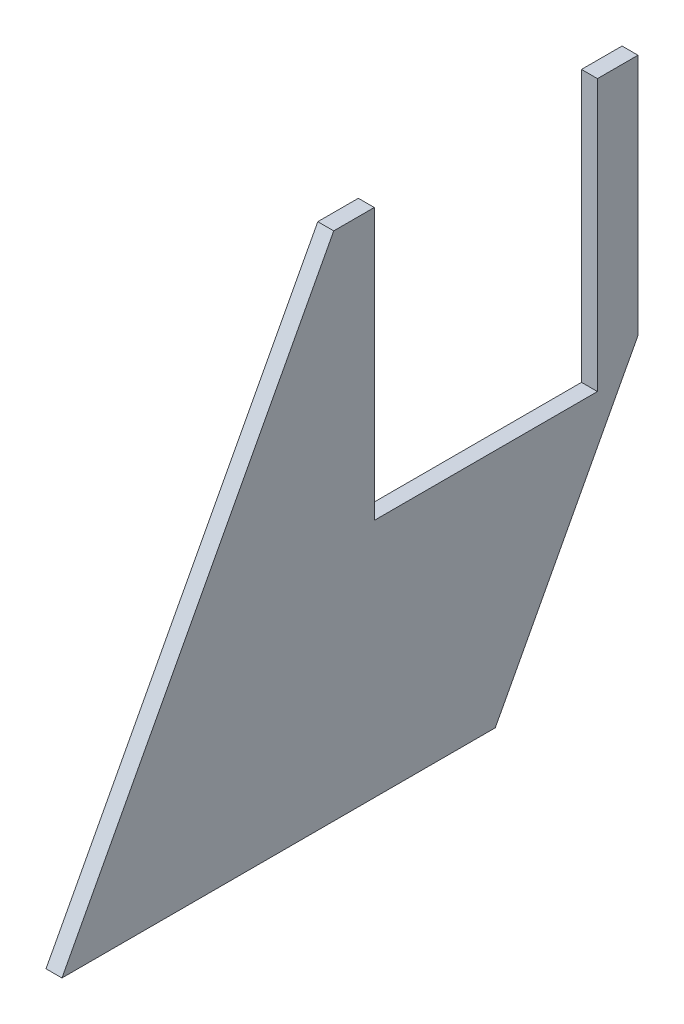
ISO-10303-21;
HEADER;
FILE_DESCRIPTION(('STEP AP214'),'2;1');
FILE_NAME('part.step','',(''),(''),'','','');
FILE_SCHEMA(('AUTOMOTIVE_DESIGN { 1 0 10303 214 1 1 1 1 }'));
ENDSEC;
DATA;
#1=APPLICATION_CONTEXT('core data for automotive mechanical design processes');
#2=APPLICATION_PROTOCOL_DEFINITION('international standard','automotive_design',2000,#1);
#3=PRODUCT_CONTEXT('',#1,'mechanical');
#4=PRODUCT('Part','Part','',(#3));
#5=PRODUCT_RELATED_PRODUCT_CATEGORY('part','',(#4));
#6=PRODUCT_DEFINITION_FORMATION('','',#4);
#7=PRODUCT_DEFINITION_CONTEXT('part definition',#1,'design');
#8=PRODUCT_DEFINITION('design','',#6,#7);
#9=PRODUCT_DEFINITION_SHAPE('','',#8);
#10=(LENGTH_UNIT() NAMED_UNIT(*) SI_UNIT(.MILLI.,.METRE.));
#11=(NAMED_UNIT(*) PLANE_ANGLE_UNIT() SI_UNIT($,.RADIAN.));
#12=(NAMED_UNIT(*) SI_UNIT($,.STERADIAN.) SOLID_ANGLE_UNIT());
#13=UNCERTAINTY_MEASURE_WITH_UNIT(LENGTH_MEASURE(1.E-05),#10,'distance_accuracy_value','');
#14=(GEOMETRIC_REPRESENTATION_CONTEXT(3) GLOBAL_UNCERTAINTY_ASSIGNED_CONTEXT((#13)) GLOBAL_UNIT_ASSIGNED_CONTEXT((#10,
#11,#12)) REPRESENTATION_CONTEXT('',''));
#15=CARTESIAN_POINT('',(0.,0.,0.));
#16=DIRECTION('',(0.,0.,1.));
#17=DIRECTION('',(1.,0.,0.));
#18=AXIS2_PLACEMENT_3D('',#15,#16,#17);
#19=CARTESIAN_POINT('',(43.65,-0.00999999999995449,-170.265974623788));
#20=DIRECTION('',(1.,0.,0.));
#21=DIRECTION('',(0.,0.,-1.));
#22=AXIS2_PLACEMENT_3D('',#19,#20,#21);
#23=PLANE('',#22);
#24=DIRECTION('',(0.,0.,1.));
#25=VECTOR('',#24,1.);
#26=CARTESIAN_POINT('',(43.65,203.6,0.));
#27=LINE('',#26,#25);
#28=CARTESIAN_POINT('',(43.65,203.6,-143.154202423773));
#29=VERTEX_POINT('',#28);
#30=CARTESIAN_POINT('',(43.65,203.6,-127.004202423773));
#31=VERTEX_POINT('',#30);
#32=EDGE_CURVE('E159',#29,#31,#27,.T.);
#33=ORIENTED_EDGE('',*,*,#32,.F.);
#34=DIRECTION('',(0.,1.,0.));
#35=VECTOR('',#34,1.);
#36=CARTESIAN_POINT('',(43.65,203.6,-143.154202423773));
#37=LINE('',#36,#35);
#38=CARTESIAN_POINT('',(43.65,106.923746647894,-143.154202423773));
#39=VERTEX_POINT('',#38);
#40=EDGE_CURVE('E173',#39,#29,#37,.T.);
#41=ORIENTED_EDGE('',*,*,#40,.F.);
#42=DIRECTION('',(0.,0.882947592858925,-0.469471562785895));
#43=VECTOR('',#42,1.);
#44=CARTESIAN_POINT('',(43.65,106.923746647894,-143.154202423773));
#45=LINE('',#44,#43);
#46=CARTESIAN_POINT('',(43.65,0.,-86.3018378625049));
#47=VERTEX_POINT('',#46);
#48=EDGE_CURVE('E115',#47,#39,#45,.T.);
#49=ORIENTED_EDGE('',*,*,#48,.F.);
#50=DIRECTION('',(0.,0.,-1.));
#51=VECTOR('',#50,1.);
#52=CARTESIAN_POINT('',(43.65,0.,0.));
#53=LINE('',#52,#51);
#54=CARTESIAN_POINT('',(43.65,0.,86.301837862505));
#55=VERTEX_POINT('',#54);
#56=EDGE_CURVE('E109',#55,#47,#53,.T.);
#57=ORIENTED_EDGE('',*,*,#56,.F.);
#58=DIRECTION('',(0.,-0.882947592858925,0.469471562785895));
#59=VECTOR('',#58,1.);
#60=CARTESIAN_POINT('',(43.65,0.,86.301837862505));
#61=LINE('',#60,#59);
#62=CARTESIAN_POINT('',(43.65,203.6,-21.9542024237733));
#63=VERTEX_POINT('',#62);
#64=EDGE_CURVE('E112',#63,#55,#61,.T.);
#65=ORIENTED_EDGE('',*,*,#64,.F.);
#66=DIRECTION('',(0.,0.,1.));
#67=VECTOR('',#66,1.);
#68=CARTESIAN_POINT('',(43.65,203.6,2.5115711979298E-13));
#69=LINE('',#68,#67);
#70=CARTESIAN_POINT('',(43.65,203.6,-38.1042024237733));
#71=VERTEX_POINT('',#70);
#72=EDGE_CURVE('E157',#71,#63,#69,.T.);
#73=ORIENTED_EDGE('',*,*,#72,.F.);
#74=DIRECTION('',(0.,1.,0.));
#75=VECTOR('',#74,1.);
#76=CARTESIAN_POINT('',(43.65,0.,-38.1042024237734));
#77=LINE('',#76,#75);
#78=CARTESIAN_POINT('',(43.65,95.6500000000001,-38.1042024237734));
#79=VERTEX_POINT('',#78);
#80=EDGE_CURVE('E11',#79,#71,#77,.T.);
#81=ORIENTED_EDGE('',*,*,#80,.F.);
#82=DIRECTION('',(0.,0.,1.));
#83=VECTOR('',#82,1.);
#84=CARTESIAN_POINT('',(43.65,95.65,0.));
#85=LINE('',#84,#83);
#86=CARTESIAN_POINT('',(43.65,95.6500000000001,-127.004202423773));
#87=VERTEX_POINT('',#86);
#88=EDGE_CURVE('E161',#87,#79,#85,.T.);
#89=ORIENTED_EDGE('',*,*,#88,.F.);
#90=DIRECTION('',(0.,-1.,0.));
#91=VECTOR('',#90,1.);
#92=CARTESIAN_POINT('',(43.65,0.,-127.004202423773));
#93=LINE('',#92,#91);
#94=EDGE_CURVE('E45',#31,#87,#93,.T.);
#95=ORIENTED_EDGE('',*,*,#94,.F.);
#96=EDGE_LOOP('',(#33,#41,#49,#57,#65,#73,#81,#89,#95));
#97=FACE_BOUND('',#96,.T.);
#98=ADVANCED_FACE('F36',(#97),#23,.F.);
#99=CARTESIAN_POINT('',(-67.585,95.6500000000001,-127.004202423773));
#100=DIRECTION('',(0.,-1.,0.));
#101=DIRECTION('',(0.,0.,-1.));
#102=AXIS2_PLACEMENT_3D('',#99,#100,#101);
#103=PLANE('',#102);
#104=DIRECTION('',(1.,0.,0.));
#105=VECTOR('',#104,1.);
#106=CARTESIAN_POINT('',(-67.585,95.6500000000001,-127.004202423773));
#107=LINE('',#106,#105);
#108=CARTESIAN_POINT('',(50.,95.6500000000001,-127.004202423773));
#109=VERTEX_POINT('',#108);
#110=EDGE_CURVE('E164',#87,#109,#107,.T.);
#111=ORIENTED_EDGE('',*,*,#110,.F.);
#112=ORIENTED_EDGE('',*,*,#88,.T.);
#113=DIRECTION('',(1.,0.,0.));
#114=VECTOR('',#113,1.);
#115=CARTESIAN_POINT('',(-67.585,95.6500000000001,-38.1042024237734));
#116=LINE('',#115,#114);
#117=CARTESIAN_POINT('',(50.,95.6500000000001,-38.1042024237734));
#118=VERTEX_POINT('',#117);
#119=EDGE_CURVE('E218',#79,#118,#116,.T.);
#120=ORIENTED_EDGE('',*,*,#119,.T.);
#121=DIRECTION('',(0.,0.,1.));
#122=VECTOR('',#121,1.);
#123=CARTESIAN_POINT('',(50.,95.6500000000001,0.));
#124=LINE('',#123,#122);
#125=EDGE_CURVE('E121',#109,#118,#124,.T.);
#126=ORIENTED_EDGE('',*,*,#125,.F.);
#127=EDGE_LOOP('',(#111,#112,#120,#126));
#128=FACE_BOUND('',#127,.T.);
#129=ADVANCED_FACE('F189',(#128),#103,.F.);
#130=CARTESIAN_POINT('',(-50.01,203.6,-38.1042024237733));
#131=DIRECTION('',(0.,0.,1.));
#132=DIRECTION('',(1.,0.,0.));
#133=AXIS2_PLACEMENT_3D('',#130,#131,#132);
#134=PLANE('',#133);
#135=ORIENTED_EDGE('',*,*,#80,.T.);
#136=DIRECTION('',(1.,0.,0.));
#137=VECTOR('',#136,1.);
#138=CARTESIAN_POINT('',(-50.01,203.6,-38.1042024237733));
#139=LINE('',#138,#137);
#140=CARTESIAN_POINT('',(50.,203.6,-38.1042024237733));
#141=VERTEX_POINT('',#140);
#142=EDGE_CURVE('E215',#71,#141,#139,.T.);
#143=ORIENTED_EDGE('',*,*,#142,.T.);
#144=DIRECTION('',(0.,-1.,0.));
#145=VECTOR('',#144,1.);
#146=CARTESIAN_POINT('',(50.,203.6,-38.1042024237733));
#147=LINE('',#146,#145);
#148=EDGE_CURVE('E60',#141,#118,#147,.T.);
#149=ORIENTED_EDGE('',*,*,#148,.T.);
#150=ORIENTED_EDGE('',*,*,#119,.F.);
#151=EDGE_LOOP('',(#135,#143,#149,#150));
#152=FACE_BOUND('',#151,.T.);
#153=ADVANCED_FACE('F195',(#152),#134,.F.);
#154=CARTESIAN_POINT('',(50.,0.,0.));
#155=DIRECTION('',(-1.,0.,0.));
#156=DIRECTION('',(0.,0.,1.));
#157=AXIS2_PLACEMENT_3D('',#154,#155,#156);
#158=PLANE('',#157);
#159=DIRECTION('',(0.,1.,0.));
#160=VECTOR('',#159,1.);
#161=CARTESIAN_POINT('',(50.,203.6,-127.004202423773));
#162=LINE('',#161,#160);
#163=CARTESIAN_POINT('',(50.,203.6,-127.004202423773));
#164=VERTEX_POINT('',#163);
#165=EDGE_CURVE('E174',#109,#164,#162,.T.);
#166=ORIENTED_EDGE('',*,*,#165,.F.);
#167=ORIENTED_EDGE('',*,*,#125,.T.);
#168=ORIENTED_EDGE('',*,*,#148,.F.);
#169=DIRECTION('',(0.,0.,1.));
#170=VECTOR('',#169,1.);
#171=CARTESIAN_POINT('',(50.,203.6,-21.9542024237733));
#172=LINE('',#171,#170);
#173=CARTESIAN_POINT('',(50.,203.6,-21.9542024237733));
#174=VERTEX_POINT('',#173);
#175=EDGE_CURVE('E147',#141,#174,#172,.T.);
#176=ORIENTED_EDGE('',*,*,#175,.T.);
#177=DIRECTION('',(0.,-0.882947592858925,0.469471562785895));
#178=VECTOR('',#177,1.);
#179=CARTESIAN_POINT('',(50.,0.,86.301837862505));
#180=LINE('',#179,#178);
#181=CARTESIAN_POINT('',(50.,0.,86.301837862505));
#182=VERTEX_POINT('',#181);
#183=EDGE_CURVE('E145',#174,#182,#180,.T.);
#184=ORIENTED_EDGE('',*,*,#183,.T.);
#185=DIRECTION('',(0.,0.,-1.));
#186=VECTOR('',#185,1.);
#187=CARTESIAN_POINT('',(50.,0.,-86.3018378625049));
#188=LINE('',#187,#186);
#189=CARTESIAN_POINT('',(50.,0.,-86.3018378625049));
#190=VERTEX_POINT('',#189);
#191=EDGE_CURVE('E132',#182,#190,#188,.T.);
#192=ORIENTED_EDGE('',*,*,#191,.T.);
#193=DIRECTION('',(0.,0.882947592858925,-0.469471562785895));
#194=VECTOR('',#193,1.);
#195=CARTESIAN_POINT('',(50.,106.923746647894,-143.154202423773));
#196=LINE('',#195,#194);
#197=CARTESIAN_POINT('',(50.,106.923746647894,-143.154202423773));
#198=VERTEX_POINT('',#197);
#199=EDGE_CURVE('E154',#190,#198,#196,.T.);
#200=ORIENTED_EDGE('',*,*,#199,.T.);
#201=DIRECTION('',(0.,1.,0.));
#202=VECTOR('',#201,1.);
#203=CARTESIAN_POINT('',(50.,203.6,-143.154202423773));
#204=LINE('',#203,#202);
#205=CARTESIAN_POINT('',(50.,203.6,-143.154202423773));
#206=VERTEX_POINT('',#205);
#207=EDGE_CURVE('E152',#198,#206,#204,.T.);
#208=ORIENTED_EDGE('',*,*,#207,.T.);
#209=DIRECTION('',(0.,0.,1.));
#210=VECTOR('',#209,1.);
#211=CARTESIAN_POINT('',(50.,203.6,-120.654202423773));
#212=LINE('',#211,#210);
#213=EDGE_CURVE('E149',#206,#164,#212,.T.);
#214=ORIENTED_EDGE('',*,*,#213,.T.);
#215=EDGE_LOOP('',(#166,#167,#168,#176,#184,#192,#200,#208,#214));
#216=FACE_BOUND('',#215,.T.);
#217=ADVANCED_FACE('F165',(#216),#158,.F.);
#218=CARTESIAN_POINT('',(-50.01,203.6,-127.004202423773));
#219=DIRECTION('',(0.,0.,-1.));
#220=DIRECTION('',(-1.,0.,0.));
#221=AXIS2_PLACEMENT_3D('',#218,#219,#220);
#222=PLANE('',#221);
#223=ORIENTED_EDGE('',*,*,#94,.T.);
#224=ORIENTED_EDGE('',*,*,#110,.T.);
#225=ORIENTED_EDGE('',*,*,#165,.T.);
#226=DIRECTION('',(1.,0.,0.));
#227=VECTOR('',#226,1.);
#228=CARTESIAN_POINT('',(-50.01,203.6,-127.004202423773));
#229=LINE('',#228,#227);
#230=EDGE_CURVE('E40',#31,#164,#229,.T.);
#231=ORIENTED_EDGE('',*,*,#230,.F.);
#232=EDGE_LOOP('',(#223,#224,#225,#231));
#233=FACE_BOUND('',#232,.T.);
#234=ADVANCED_FACE('F38',(#233),#222,.F.);
#235=CARTESIAN_POINT('',(50.,203.6,-143.154202423773));
#236=DIRECTION('',(0.,0.,1.));
#237=DIRECTION('',(0.,-1.,0.));
#238=AXIS2_PLACEMENT_3D('',#235,#236,#237);
#239=PLANE('',#238);
#240=DIRECTION('',(-1.,0.,0.));
#241=VECTOR('',#240,1.);
#242=CARTESIAN_POINT('',(50.,106.923746647894,-143.154202423773));
#243=LINE('',#242,#241);
#244=EDGE_CURVE('E133',#198,#39,#243,.T.);
#245=ORIENTED_EDGE('',*,*,#244,.T.);
#246=ORIENTED_EDGE('',*,*,#40,.T.);
#247=DIRECTION('',(-1.,0.,0.));
#248=VECTOR('',#247,1.);
#249=CARTESIAN_POINT('',(50.,203.6,-143.154202423773));
#250=LINE('',#249,#248);
#251=EDGE_CURVE('E136',#206,#29,#250,.T.);
#252=ORIENTED_EDGE('',*,*,#251,.F.);
#253=ORIENTED_EDGE('',*,*,#207,.F.);
#254=EDGE_LOOP('',(#245,#246,#252,#253));
#255=FACE_BOUND('',#254,.T.);
#256=ADVANCED_FACE('F172',(#255),#239,.F.);
#257=CARTESIAN_POINT('',(50.,203.6,-120.654202423773));
#258=DIRECTION('',(0.,-1.,0.));
#259=DIRECTION('',(0.,0.,-1.));
#260=AXIS2_PLACEMENT_3D('',#257,#258,#259);
#261=PLANE('',#260);
#262=ORIENTED_EDGE('',*,*,#251,.T.);
#263=ORIENTED_EDGE('',*,*,#32,.T.);
#264=ORIENTED_EDGE('',*,*,#230,.T.);
#265=ORIENTED_EDGE('',*,*,#213,.F.);
#266=EDGE_LOOP('',(#262,#263,#264,#265));
#267=FACE_BOUND('',#266,.T.);
#268=ADVANCED_FACE('F176',(#267),#261,.F.);
#269=CARTESIAN_POINT('',(50.,0.,86.301837862505));
#270=DIRECTION('',(0.,-0.469471562785895,-0.882947592858925));
#271=DIRECTION('',(0.,0.882947592858925,-0.469471562785895));
#272=AXIS2_PLACEMENT_3D('',#269,#270,#271);
#273=PLANE('',#272);
#274=DIRECTION('',(-1.,0.,0.));
#275=VECTOR('',#274,1.);
#276=CARTESIAN_POINT('',(50.,203.6,-21.9542024237733));
#277=LINE('',#276,#275);
#278=EDGE_CURVE('E129',#174,#63,#277,.T.);
#279=ORIENTED_EDGE('',*,*,#278,.T.);
#280=ORIENTED_EDGE('',*,*,#64,.T.);
#281=DIRECTION('',(-1.,0.,0.));
#282=VECTOR('',#281,1.);
#283=CARTESIAN_POINT('',(50.,0.,86.301837862505));
#284=LINE('',#283,#282);
#285=EDGE_CURVE('E120',#182,#55,#284,.T.);
#286=ORIENTED_EDGE('',*,*,#285,.F.);
#287=ORIENTED_EDGE('',*,*,#183,.F.);
#288=EDGE_LOOP('',(#279,#280,#286,#287));
#289=FACE_BOUND('',#288,.T.);
#290=ADVANCED_FACE('F125',(#289),#273,.F.);
#291=CARTESIAN_POINT('',(50.,203.6,-21.9542024237733));
#292=DIRECTION('',(0.,-1.,0.));
#293=DIRECTION('',(0.,0.,-1.));
#294=AXIS2_PLACEMENT_3D('',#291,#292,#293);
#295=PLANE('',#294);
#296=ORIENTED_EDGE('',*,*,#72,.T.);
#297=ORIENTED_EDGE('',*,*,#278,.F.);
#298=ORIENTED_EDGE('',*,*,#175,.F.);
#299=ORIENTED_EDGE('',*,*,#142,.F.);
#300=EDGE_LOOP('',(#296,#297,#298,#299));
#301=FACE_BOUND('',#300,.T.);
#302=ADVANCED_FACE('F183',(#301),#295,.F.);
#303=CARTESIAN_POINT('',(50.,106.923746647894,-143.154202423773));
#304=DIRECTION('',(0.,0.469471562785895,0.882947592858925));
#305=DIRECTION('',(0.,-0.882947592858925,0.469471562785895));
#306=AXIS2_PLACEMENT_3D('',#303,#304,#305);
#307=PLANE('',#306);
#308=DIRECTION('',(-1.,0.,0.));
#309=VECTOR('',#308,1.);
#310=CARTESIAN_POINT('',(50.,0.,-86.3018378625049));
#311=LINE('',#310,#309);
#312=EDGE_CURVE('E138',#190,#47,#311,.T.);
#313=ORIENTED_EDGE('',*,*,#312,.T.);
#314=ORIENTED_EDGE('',*,*,#48,.T.);
#315=ORIENTED_EDGE('',*,*,#244,.F.);
#316=ORIENTED_EDGE('',*,*,#199,.F.);
#317=EDGE_LOOP('',(#313,#314,#315,#316));
#318=FACE_BOUND('',#317,.T.);
#319=ADVANCED_FACE('F169',(#318),#307,.F.);
#320=CARTESIAN_POINT('',(-62.575,0.,-143.164202423773));
#321=DIRECTION('',(0.,-1.,0.));
#322=DIRECTION('',(1.,0.,0.));
#323=AXIS2_PLACEMENT_3D('',#320,#321,#322);
#324=PLANE('',#323);
#325=ORIENTED_EDGE('',*,*,#56,.T.);
#326=ORIENTED_EDGE('',*,*,#312,.F.);
#327=ORIENTED_EDGE('',*,*,#191,.F.);
#328=ORIENTED_EDGE('',*,*,#285,.T.);
#329=EDGE_LOOP('',(#325,#326,#327,#328));
#330=FACE_BOUND('',#329,.T.);
#331=ADVANCED_FACE('F131',(#330),#324,.T.);
#332=CLOSED_SHELL('',(#98,#129,#153,#217,#234,#256,#268,#290,#302,#319,#331));
#333=MANIFOLD_SOLID_BREP('B2',#332);
#334=ADVANCED_BREP_SHAPE_REPRESENTATION('',(#18,#333),#14);
#335=SHAPE_DEFINITION_REPRESENTATION(#9,#334);
ENDSEC;
END-ISO-10303-21;
